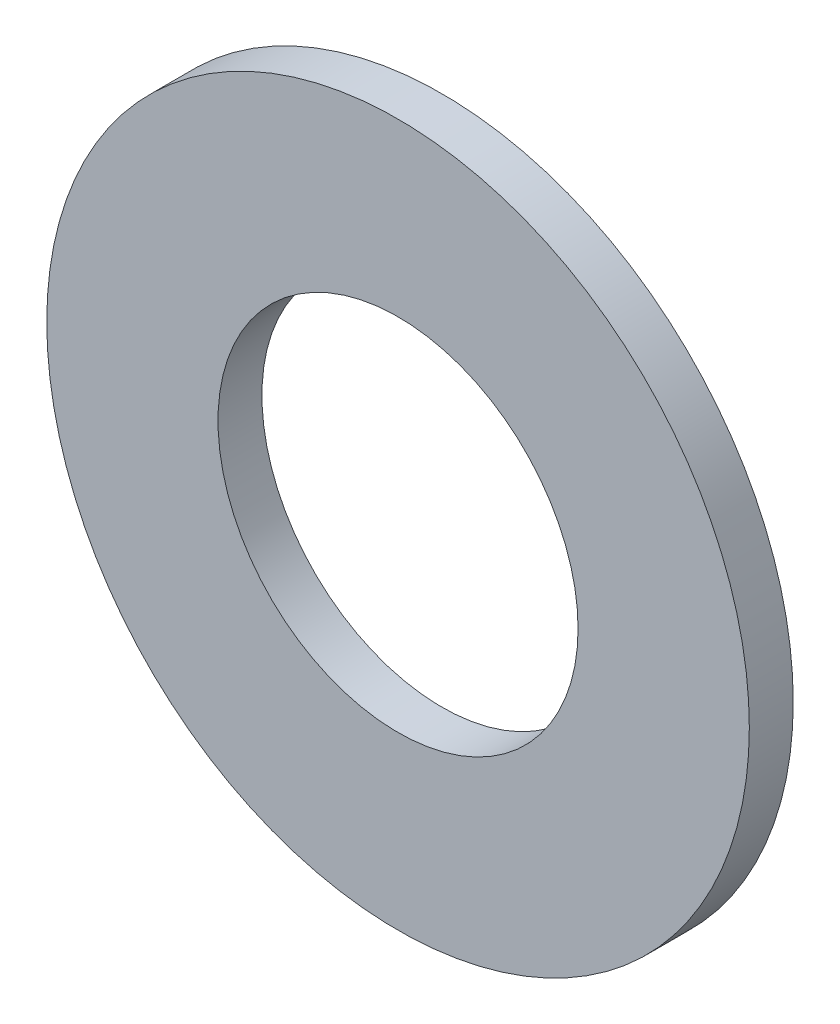
ISO-10303-21;
HEADER;
FILE_DESCRIPTION(('STEP AP214'),'2;1');
FILE_NAME('part.step','',(''),(''),'','','');
FILE_SCHEMA(('AUTOMOTIVE_DESIGN { 1 0 10303 214 1 1 1 1 }'));
ENDSEC;
DATA;
#1=APPLICATION_CONTEXT('core data for automotive mechanical design processes');
#2=APPLICATION_PROTOCOL_DEFINITION('international standard','automotive_design',2000,#1);
#3=PRODUCT_CONTEXT('',#1,'mechanical');
#4=PRODUCT('Part','Part','',(#3));
#5=PRODUCT_RELATED_PRODUCT_CATEGORY('part','',(#4));
#6=PRODUCT_DEFINITION_FORMATION('','',#4);
#7=PRODUCT_DEFINITION_CONTEXT('part definition',#1,'design');
#8=PRODUCT_DEFINITION('design','',#6,#7);
#9=PRODUCT_DEFINITION_SHAPE('','',#8);
#10=(LENGTH_UNIT() NAMED_UNIT(*) SI_UNIT(.MILLI.,.METRE.));
#11=(NAMED_UNIT(*) PLANE_ANGLE_UNIT() SI_UNIT($,.RADIAN.));
#12=(NAMED_UNIT(*) SI_UNIT($,.STERADIAN.) SOLID_ANGLE_UNIT());
#13=UNCERTAINTY_MEASURE_WITH_UNIT(LENGTH_MEASURE(1.E-05),#10,'distance_accuracy_value','');
#14=(GEOMETRIC_REPRESENTATION_CONTEXT(3) GLOBAL_UNCERTAINTY_ASSIGNED_CONTEXT((#13)) GLOBAL_UNIT_ASSIGNED_CONTEXT((#10,
#11,#12)) REPRESENTATION_CONTEXT('',''));
#15=CARTESIAN_POINT('',(0.,0.,0.));
#16=DIRECTION('',(0.,0.,1.));
#17=DIRECTION('',(1.,0.,0.));
#18=AXIS2_PLACEMENT_3D('',#15,#16,#17);
#19=CARTESIAN_POINT('',(0.,0.,-0.499999999999999));
#20=DIRECTION('',(0.,0.,1.));
#21=DIRECTION('',(1.,0.,0.));
#22=AXIS2_PLACEMENT_3D('',#19,#20,#21);
#23=PLANE('',#22);
#24=CARTESIAN_POINT('',(0.,0.,-0.499999999999997));
#25=DIRECTION('',(0.,0.,1.));
#26=DIRECTION('',(1.,0.,0.));
#27=AXIS2_PLACEMENT_3D('',#24,#25,#26);
#28=CIRCLE('',#27,4.1);
#29=CARTESIAN_POINT('',(4.1,0.,-0.499999999999997));
#30=VERTEX_POINT('',#29);
#31=EDGE_CURVE('E42',#30,#30,#28,.T.);
#32=ORIENTED_EDGE('',*,*,#31,.T.);
#33=EDGE_LOOP('',(#32));
#34=FACE_BOUND('',#33,.T.);
#35=CARTESIAN_POINT('',(0.,0.,-0.499999999999997));
#36=DIRECTION('',(0.,0.,1.));
#37=DIRECTION('',(1.,0.,0.));
#38=AXIS2_PLACEMENT_3D('',#35,#36,#37);
#39=CIRCLE('',#38,8.);
#40=CARTESIAN_POINT('',(8.,0.,-0.499999999999997));
#41=VERTEX_POINT('',#40);
#42=EDGE_CURVE('E10',#41,#41,#39,.T.);
#43=ORIENTED_EDGE('',*,*,#42,.F.);
#44=EDGE_LOOP('',(#43));
#45=FACE_BOUND('',#44,.T.);
#46=ADVANCED_FACE('F32',(#34,#45),#23,.F.);
#47=CARTESIAN_POINT('',(0.,0.,20.3648090279095));
#48=DIRECTION('',(0.,0.,1.));
#49=DIRECTION('',(1.,0.,0.));
#50=AXIS2_PLACEMENT_3D('',#47,#48,#49);
#51=CYLINDRICAL_SURFACE('',#50,8.);
#52=CARTESIAN_POINT('',(0.,0.,0.500000000000004));
#53=DIRECTION('',(0.,0.,1.));
#54=DIRECTION('',(1.,0.,0.));
#55=AXIS2_PLACEMENT_3D('',#52,#53,#54);
#56=CIRCLE('',#55,8.);
#57=CARTESIAN_POINT('',(8.,0.,0.500000000000004));
#58=VERTEX_POINT('',#57);
#59=EDGE_CURVE('E38',#58,#58,#56,.T.);
#60=ORIENTED_EDGE('',*,*,#59,.F.);
#61=EDGE_LOOP('',(#60));
#62=FACE_BOUND('',#61,.T.);
#63=ORIENTED_EDGE('',*,*,#42,.T.);
#64=EDGE_LOOP('',(#63));
#65=FACE_BOUND('',#64,.T.);
#66=ADVANCED_FACE('F56',(#62,#65),#51,.T.);
#67=CARTESIAN_POINT('',(-8.,0.,0.500000000000002));
#68=DIRECTION('',(0.,0.,-1.));
#69=DIRECTION('',(-1.,0.,0.));
#70=AXIS2_PLACEMENT_3D('',#67,#68,#69);
#71=PLANE('',#70);
#72=CARTESIAN_POINT('',(0.,0.,0.500000000000002));
#73=DIRECTION('',(0.,0.,1.));
#74=DIRECTION('',(1.,0.,0.));
#75=AXIS2_PLACEMENT_3D('',#72,#73,#74);
#76=CIRCLE('',#75,4.1);
#77=CARTESIAN_POINT('',(4.1,0.,0.500000000000002));
#78=VERTEX_POINT('',#77);
#79=EDGE_CURVE('E46',#78,#78,#76,.T.);
#80=ORIENTED_EDGE('',*,*,#79,.F.);
#81=EDGE_LOOP('',(#80));
#82=FACE_BOUND('',#81,.T.);
#83=ORIENTED_EDGE('',*,*,#59,.T.);
#84=EDGE_LOOP('',(#83));
#85=FACE_BOUND('',#84,.T.);
#86=ADVANCED_FACE('F54',(#82,#85),#71,.F.);
#87=CARTESIAN_POINT('',(0.,0.,0.500000000000002));
#88=DIRECTION('',(0.,0.,1.));
#89=DIRECTION('',(1.,0.,0.));
#90=AXIS2_PLACEMENT_3D('',#87,#88,#89);
#91=CYLINDRICAL_SURFACE('',#90,4.1);
#92=ORIENTED_EDGE('',*,*,#31,.F.);
#93=EDGE_LOOP('',(#92));
#94=FACE_BOUND('',#93,.T.);
#95=ORIENTED_EDGE('',*,*,#79,.T.);
#96=EDGE_LOOP('',(#95));
#97=FACE_BOUND('',#96,.T.);
#98=ADVANCED_FACE('F52',(#94,#97),#91,.F.);
#99=CLOSED_SHELL('',(#46,#66,#86,#98));
#100=MANIFOLD_SOLID_BREP('B2',#99);
#101=ADVANCED_BREP_SHAPE_REPRESENTATION('',(#18,#100),#14);
#102=SHAPE_DEFINITION_REPRESENTATION(#9,#101);
ENDSEC;
END-ISO-10303-21;
